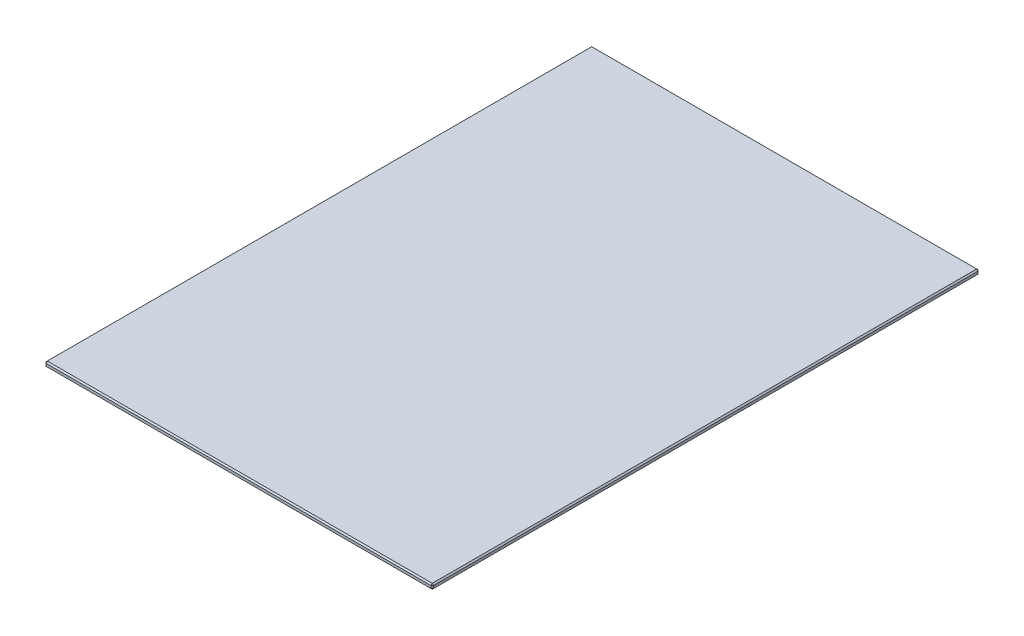
ISO-10303-21;
HEADER;
FILE_DESCRIPTION(('STEP AP214'),'2;1');
FILE_NAME('part.step','',(''),(''),'','','');
FILE_SCHEMA(('AUTOMOTIVE_DESIGN { 1 0 10303 214 1 1 1 1 }'));
ENDSEC;
DATA;
#1=APPLICATION_CONTEXT('core data for automotive mechanical design processes');
#2=APPLICATION_PROTOCOL_DEFINITION('international standard','automotive_design',2000,#1);
#3=PRODUCT_CONTEXT('',#1,'mechanical');
#4=PRODUCT('Part','Part','',(#3));
#5=PRODUCT_RELATED_PRODUCT_CATEGORY('part','',(#4));
#6=PRODUCT_DEFINITION_FORMATION('','',#4);
#7=PRODUCT_DEFINITION_CONTEXT('part definition',#1,'design');
#8=PRODUCT_DEFINITION('design','',#6,#7);
#9=PRODUCT_DEFINITION_SHAPE('','',#8);
#10=(LENGTH_UNIT() NAMED_UNIT(*) SI_UNIT(.MILLI.,.METRE.));
#11=(NAMED_UNIT(*) PLANE_ANGLE_UNIT() SI_UNIT($,.RADIAN.));
#12=(NAMED_UNIT(*) SI_UNIT($,.STERADIAN.) SOLID_ANGLE_UNIT());
#13=UNCERTAINTY_MEASURE_WITH_UNIT(LENGTH_MEASURE(1.E-05),#10,'distance_accuracy_value','');
#14=(GEOMETRIC_REPRESENTATION_CONTEXT(3) GLOBAL_UNCERTAINTY_ASSIGNED_CONTEXT((#13)) GLOBAL_UNIT_ASSIGNED_CONTEXT((#10,
#11,#12)) REPRESENTATION_CONTEXT('',''));
#15=CARTESIAN_POINT('',(0.,0.,0.));
#16=DIRECTION('',(0.,0.,1.));
#17=DIRECTION('',(1.,0.,0.));
#18=AXIS2_PLACEMENT_3D('',#15,#16,#17);
#19=CARTESIAN_POINT('',(-149.5,4.,211.));
#20=DIRECTION('',(1.,0.,0.));
#21=DIRECTION('',(0.,0.,-1.));
#22=AXIS2_PLACEMENT_3D('',#19,#20,#21);
#23=PLANE('',#22);
#24=DIRECTION('',(0.,-1.,0.));
#25=VECTOR('',#24,1.);
#26=CARTESIAN_POINT('',(-149.5,4.,-210.));
#27=LINE('',#26,#25);
#28=CARTESIAN_POINT('',(-149.5,3.,-210.));
#29=VERTEX_POINT('',#28);
#30=CARTESIAN_POINT('',(-149.5,1.,-210.));
#31=VERTEX_POINT('',#30);
#32=EDGE_CURVE('E193',#29,#31,#27,.T.);
#33=ORIENTED_EDGE('',*,*,#32,.T.);
#34=DIRECTION('',(0.,0.,1.));
#35=VECTOR('',#34,1.);
#36=CARTESIAN_POINT('',(-149.5,1.,211.));
#37=LINE('',#36,#35);
#38=CARTESIAN_POINT('',(-149.5,1.,210.));
#39=VERTEX_POINT('',#38);
#40=EDGE_CURVE('E195',#31,#39,#37,.T.);
#41=ORIENTED_EDGE('',*,*,#40,.T.);
#42=DIRECTION('',(0.,1.,0.));
#43=VECTOR('',#42,1.);
#44=CARTESIAN_POINT('',(-149.5,4.,210.));
#45=LINE('',#44,#43);
#46=CARTESIAN_POINT('',(-149.5,3.,210.));
#47=VERTEX_POINT('',#46);
#48=EDGE_CURVE('E189',#39,#47,#45,.T.);
#49=ORIENTED_EDGE('',*,*,#48,.T.);
#50=DIRECTION('',(0.,0.,-1.));
#51=VECTOR('',#50,1.);
#52=CARTESIAN_POINT('',(-149.5,3.,211.));
#53=LINE('',#52,#51);
#54=EDGE_CURVE('E191',#47,#29,#53,.T.);
#55=ORIENTED_EDGE('',*,*,#54,.T.);
#56=EDGE_LOOP('',(#33,#41,#49,#55));
#57=FACE_BOUND('',#56,.T.);
#58=ADVANCED_FACE('F34',(#57),#23,.F.);
#59=CARTESIAN_POINT('',(-149.5,4.,211.));
#60=DIRECTION('',(0.,0.,-1.));
#61=DIRECTION('',(-1.,0.,0.));
#62=AXIS2_PLACEMENT_3D('',#59,#60,#61);
#63=PLANE('',#62);
#64=DIRECTION('',(0.,-1.,0.));
#65=VECTOR('',#64,1.);
#66=CARTESIAN_POINT('',(-148.5,4.,211.));
#67=LINE('',#66,#65);
#68=CARTESIAN_POINT('',(-148.5,3.,211.));
#69=VERTEX_POINT('',#68);
#70=CARTESIAN_POINT('',(-148.5,1.,211.));
#71=VERTEX_POINT('',#70);
#72=EDGE_CURVE('E126',#69,#71,#67,.T.);
#73=ORIENTED_EDGE('',*,*,#72,.T.);
#74=DIRECTION('',(1.,0.,0.));
#75=VECTOR('',#74,1.);
#76=CARTESIAN_POINT('',(149.5,1.,211.));
#77=LINE('',#76,#75);
#78=CARTESIAN_POINT('',(148.5,1.,211.));
#79=VERTEX_POINT('',#78);
#80=EDGE_CURVE('E160',#71,#79,#77,.T.);
#81=ORIENTED_EDGE('',*,*,#80,.T.);
#82=DIRECTION('',(0.,1.,0.));
#83=VECTOR('',#82,1.);
#84=CARTESIAN_POINT('',(148.5,4.,211.));
#85=LINE('',#84,#83);
#86=CARTESIAN_POINT('',(148.5,3.,211.));
#87=VERTEX_POINT('',#86);
#88=EDGE_CURVE('E129',#79,#87,#85,.T.);
#89=ORIENTED_EDGE('',*,*,#88,.T.);
#90=DIRECTION('',(-1.,0.,0.));
#91=VECTOR('',#90,1.);
#92=CARTESIAN_POINT('',(-149.5,3.,211.));
#93=LINE('',#92,#91);
#94=EDGE_CURVE('E121',#87,#69,#93,.T.);
#95=ORIENTED_EDGE('',*,*,#94,.T.);
#96=EDGE_LOOP('',(#73,#81,#89,#95));
#97=FACE_BOUND('',#96,.T.);
#98=ADVANCED_FACE('F123',(#97),#63,.F.);
#99=CARTESIAN_POINT('',(149.5,4.,211.));
#100=DIRECTION('',(-1.,0.,0.));
#101=DIRECTION('',(0.,0.,1.));
#102=AXIS2_PLACEMENT_3D('',#99,#100,#101);
#103=PLANE('',#102);
#104=DIRECTION('',(0.,-1.,0.));
#105=VECTOR('',#104,1.);
#106=CARTESIAN_POINT('',(149.5,4.,210.));
#107=LINE('',#106,#105);
#108=CARTESIAN_POINT('',(149.5,3.,210.));
#109=VERTEX_POINT('',#108);
#110=CARTESIAN_POINT('',(149.5,1.,210.));
#111=VERTEX_POINT('',#110);
#112=EDGE_CURVE('E171',#109,#111,#107,.T.);
#113=ORIENTED_EDGE('',*,*,#112,.T.);
#114=DIRECTION('',(0.,0.,-1.));
#115=VECTOR('',#114,1.);
#116=CARTESIAN_POINT('',(149.5,1.,-211.));
#117=LINE('',#116,#115);
#118=CARTESIAN_POINT('',(149.5,1.,-210.));
#119=VERTEX_POINT('',#118);
#120=EDGE_CURVE('E177',#111,#119,#117,.T.);
#121=ORIENTED_EDGE('',*,*,#120,.T.);
#122=DIRECTION('',(0.,1.,0.));
#123=VECTOR('',#122,1.);
#124=CARTESIAN_POINT('',(149.5,4.,-210.));
#125=LINE('',#124,#123);
#126=CARTESIAN_POINT('',(149.5,3.,-210.));
#127=VERTEX_POINT('',#126);
#128=EDGE_CURVE('E175',#119,#127,#125,.T.);
#129=ORIENTED_EDGE('',*,*,#128,.T.);
#130=DIRECTION('',(0.,0.,1.));
#131=VECTOR('',#130,1.);
#132=CARTESIAN_POINT('',(149.5,3.,211.));
#133=LINE('',#132,#131);
#134=EDGE_CURVE('E173',#127,#109,#133,.T.);
#135=ORIENTED_EDGE('',*,*,#134,.T.);
#136=EDGE_LOOP('',(#113,#121,#129,#135));
#137=FACE_BOUND('',#136,.T.);
#138=ADVANCED_FACE('F264',(#137),#103,.F.);
#139=CARTESIAN_POINT('',(-149.5,4.,-211.));
#140=DIRECTION('',(0.,0.,1.));
#141=DIRECTION('',(1.,0.,0.));
#142=AXIS2_PLACEMENT_3D('',#139,#140,#141);
#143=PLANE('',#142);
#144=DIRECTION('',(1.,0.,0.));
#145=VECTOR('',#144,1.);
#146=CARTESIAN_POINT('',(-149.5,3.,-211.));
#147=LINE('',#146,#145);
#148=CARTESIAN_POINT('',(-148.5,3.,-211.));
#149=VERTEX_POINT('',#148);
#150=CARTESIAN_POINT('',(148.5,3.,-211.));
#151=VERTEX_POINT('',#150);
#152=EDGE_CURVE('E182',#149,#151,#147,.T.);
#153=ORIENTED_EDGE('',*,*,#152,.T.);
#154=DIRECTION('',(0.,-1.,0.));
#155=VECTOR('',#154,1.);
#156=CARTESIAN_POINT('',(148.5,4.,-211.));
#157=LINE('',#156,#155);
#158=CARTESIAN_POINT('',(148.5,1.,-211.));
#159=VERTEX_POINT('',#158);
#160=EDGE_CURVE('E187',#151,#159,#157,.T.);
#161=ORIENTED_EDGE('',*,*,#160,.T.);
#162=DIRECTION('',(-1.,0.,0.));
#163=VECTOR('',#162,1.);
#164=CARTESIAN_POINT('',(-149.5,1.,-211.));
#165=LINE('',#164,#163);
#166=CARTESIAN_POINT('',(-148.5,1.,-211.));
#167=VERTEX_POINT('',#166);
#168=EDGE_CURVE('E184',#159,#167,#165,.T.);
#169=ORIENTED_EDGE('',*,*,#168,.T.);
#170=DIRECTION('',(0.,1.,0.));
#171=VECTOR('',#170,1.);
#172=CARTESIAN_POINT('',(-148.5,4.,-211.));
#173=LINE('',#172,#171);
#174=EDGE_CURVE('E180',#167,#149,#173,.T.);
#175=ORIENTED_EDGE('',*,*,#174,.T.);
#176=EDGE_LOOP('',(#153,#161,#169,#175));
#177=FACE_BOUND('',#176,.T.);
#178=ADVANCED_FACE('F273',(#177),#143,.F.);
#179=CARTESIAN_POINT('',(0.,4.,0.));
#180=DIRECTION('',(0.,-1.,0.));
#181=DIRECTION('',(0.,0.,-1.));
#182=AXIS2_PLACEMENT_3D('',#179,#180,#181);
#183=PLANE('',#182);
#184=DIRECTION('',(0.,0.,-1.));
#185=VECTOR('',#184,1.);
#186=CARTESIAN_POINT('',(148.5,4.,0.));
#187=LINE('',#186,#185);
#188=CARTESIAN_POINT('',(148.5,4.,210.));
#189=VERTEX_POINT('',#188);
#190=CARTESIAN_POINT('',(148.5,4.,-210.));
#191=VERTEX_POINT('',#190);
#192=EDGE_CURVE('E43',#189,#191,#187,.T.);
#193=ORIENTED_EDGE('',*,*,#192,.T.);
#194=DIRECTION('',(-1.,0.,0.));
#195=VECTOR('',#194,1.);
#196=CARTESIAN_POINT('',(0.,4.,-210.));
#197=LINE('',#196,#195);
#198=CARTESIAN_POINT('',(-148.5,4.,-210.));
#199=VERTEX_POINT('',#198);
#200=EDGE_CURVE('E11',#191,#199,#197,.T.);
#201=ORIENTED_EDGE('',*,*,#200,.T.);
#202=DIRECTION('',(0.,0.,1.));
#203=VECTOR('',#202,1.);
#204=CARTESIAN_POINT('',(-148.5,4.,0.));
#205=LINE('',#204,#203);
#206=CARTESIAN_POINT('',(-148.5,4.,210.));
#207=VERTEX_POINT('',#206);
#208=EDGE_CURVE('E198',#199,#207,#205,.T.);
#209=ORIENTED_EDGE('',*,*,#208,.T.);
#210=DIRECTION('',(1.,0.,0.));
#211=VECTOR('',#210,1.);
#212=CARTESIAN_POINT('',(0.,4.,210.));
#213=LINE('',#212,#211);
#214=EDGE_CURVE('E54',#207,#189,#213,.T.);
#215=ORIENTED_EDGE('',*,*,#214,.T.);
#216=EDGE_LOOP('',(#193,#201,#209,#215));
#217=FACE_BOUND('',#216,.T.);
#218=ADVANCED_FACE('F295',(#217),#183,.F.);
#219=CARTESIAN_POINT('',(0.,0.,0.));
#220=DIRECTION('',(0.,-1.,0.));
#221=DIRECTION('',(0.,0.,-1.));
#222=AXIS2_PLACEMENT_3D('',#219,#220,#221);
#223=PLANE('',#222);
#224=DIRECTION('',(0.,0.,1.));
#225=VECTOR('',#224,1.);
#226=CARTESIAN_POINT('',(148.5,0.,211.));
#227=LINE('',#226,#225);
#228=CARTESIAN_POINT('',(148.5,0.,-210.));
#229=VERTEX_POINT('',#228);
#230=CARTESIAN_POINT('',(148.5,0.,210.));
#231=VERTEX_POINT('',#230);
#232=EDGE_CURVE('E166',#229,#231,#227,.T.);
#233=ORIENTED_EDGE('',*,*,#232,.T.);
#234=DIRECTION('',(-1.,0.,0.));
#235=VECTOR('',#234,1.);
#236=CARTESIAN_POINT('',(-149.5,0.,210.));
#237=LINE('',#236,#235);
#238=CARTESIAN_POINT('',(-148.5,0.,210.));
#239=VERTEX_POINT('',#238);
#240=EDGE_CURVE('E168',#231,#239,#237,.T.);
#241=ORIENTED_EDGE('',*,*,#240,.T.);
#242=DIRECTION('',(0.,0.,-1.));
#243=VECTOR('',#242,1.);
#244=CARTESIAN_POINT('',(-148.5,0.,-211.));
#245=LINE('',#244,#243);
#246=CARTESIAN_POINT('',(-148.5,0.,-210.));
#247=VERTEX_POINT('',#246);
#248=EDGE_CURVE('E162',#239,#247,#245,.T.);
#249=ORIENTED_EDGE('',*,*,#248,.T.);
#250=DIRECTION('',(1.,0.,0.));
#251=VECTOR('',#250,1.);
#252=CARTESIAN_POINT('',(149.5,0.,-210.));
#253=LINE('',#252,#251);
#254=EDGE_CURVE('E164',#247,#229,#253,.T.);
#255=ORIENTED_EDGE('',*,*,#254,.T.);
#256=EDGE_LOOP('',(#233,#241,#249,#255));
#257=FACE_BOUND('',#256,.T.);
#258=ADVANCED_FACE('F297',(#257),#223,.T.);
#259=CARTESIAN_POINT('',(0.,4.,-210.));
#260=DIRECTION('',(0.,-0.707106781186547,0.707106781186547));
#261=DIRECTION('',(-1.,0.,0.));
#262=AXIS2_PLACEMENT_3D('',#259,#260,#261);
#263=PLANE('',#262);
#264=DIRECTION('',(0.,0.707106781186547,0.707106781186547));
#265=VECTOR('',#264,1.);
#266=CARTESIAN_POINT('',(-148.5,4.,-210.));
#267=LINE('',#266,#265);
#268=EDGE_CURVE('E38',#199,#149,#267,.F.);
#269=ORIENTED_EDGE('',*,*,#268,.F.);
#270=ORIENTED_EDGE('',*,*,#200,.F.);
#271=DIRECTION('',(0.,-0.707106781186547,-0.707106781186547));
#272=VECTOR('',#271,1.);
#273=CARTESIAN_POINT('',(148.5,3.,-211.));
#274=LINE('',#273,#272);
#275=EDGE_CURVE('E157',#151,#191,#274,.F.);
#276=ORIENTED_EDGE('',*,*,#275,.F.);
#277=ORIENTED_EDGE('',*,*,#152,.F.);
#278=EDGE_LOOP('',(#269,#270,#276,#277));
#279=FACE_BOUND('',#278,.T.);
#280=ADVANCED_FACE('F36',(#279),#263,.F.);
#281=CARTESIAN_POINT('',(-148.5,4.,-210.));
#282=DIRECTION('',(-0.577350269189626,0.577350269189626,-0.577350269189626));
#283=DIRECTION('',(-0.707106781186547,0.,0.707106781186547));
#284=AXIS2_PLACEMENT_3D('',#281,#282,#283);
#285=PLANE('',#284);
#286=DIRECTION('',(-0.707106781186547,-0.707106781186547,0.));
#287=VECTOR('',#286,1.);
#288=CARTESIAN_POINT('',(-148.5,4.,-210.));
#289=LINE('',#288,#287);
#290=EDGE_CURVE('E244',#199,#29,#289,.T.);
#291=ORIENTED_EDGE('',*,*,#290,.F.);
#292=ORIENTED_EDGE('',*,*,#268,.T.);
#293=DIRECTION('',(0.707106781186547,0.,-0.707106781186547));
#294=VECTOR('',#293,1.);
#295=CARTESIAN_POINT('',(-149.,3.,-210.5));
#296=LINE('',#295,#294);
#297=EDGE_CURVE('E247',#29,#149,#296,.T.);
#298=ORIENTED_EDGE('',*,*,#297,.F.);
#299=EDGE_LOOP('',(#291,#292,#298));
#300=FACE_BOUND('',#299,.T.);
#301=ADVANCED_FACE('F291',(#300),#285,.T.);
#302=CARTESIAN_POINT('',(148.5,3.,-211.));
#303=DIRECTION('',(0.577350269189626,0.577350269189626,-0.577350269189626));
#304=DIRECTION('',(-0.707106781186547,0.,-0.707106781186547));
#305=AXIS2_PLACEMENT_3D('',#302,#303,#304);
#306=PLANE('',#305);
#307=DIRECTION('',(0.707106781186547,0.,0.707106781186547));
#308=VECTOR('',#307,1.);
#309=CARTESIAN_POINT('',(148.5,3.,-211.));
#310=LINE('',#309,#308);
#311=EDGE_CURVE('E238',#151,#127,#310,.T.);
#312=ORIENTED_EDGE('',*,*,#311,.F.);
#313=ORIENTED_EDGE('',*,*,#275,.T.);
#314=DIRECTION('',(-0.707106781186547,0.707106781186547,0.));
#315=VECTOR('',#314,1.);
#316=CARTESIAN_POINT('',(149.,3.5,-210.));
#317=LINE('',#316,#315);
#318=EDGE_CURVE('E241',#127,#191,#317,.T.);
#319=ORIENTED_EDGE('',*,*,#318,.F.);
#320=EDGE_LOOP('',(#312,#313,#319));
#321=FACE_BOUND('',#320,.T.);
#322=ADVANCED_FACE('F254',(#321),#306,.T.);
#323=CARTESIAN_POINT('',(-149.5,4.,-210.));
#324=DIRECTION('',(0.707106781186547,0.,0.707106781186547));
#325=DIRECTION('',(0.,-1.,0.));
#326=AXIS2_PLACEMENT_3D('',#323,#324,#325);
#327=PLANE('',#326);
#328=ORIENTED_EDGE('',*,*,#297,.T.);
#329=ORIENTED_EDGE('',*,*,#174,.F.);
#330=DIRECTION('',(-0.707106781186547,0.,0.707106781186547));
#331=VECTOR('',#330,1.);
#332=CARTESIAN_POINT('',(-148.5,1.,-211.));
#333=LINE('',#332,#331);
#334=EDGE_CURVE('E233',#31,#167,#333,.F.);
#335=ORIENTED_EDGE('',*,*,#334,.F.);
#336=ORIENTED_EDGE('',*,*,#32,.F.);
#337=EDGE_LOOP('',(#328,#329,#335,#336));
#338=FACE_BOUND('',#337,.T.);
#339=ADVANCED_FACE('F285',(#338),#327,.F.);
#340=CARTESIAN_POINT('',(-148.5,4.,0.));
#341=DIRECTION('',(0.707106781186547,-0.707106781186547,0.));
#342=DIRECTION('',(0.,0.,1.));
#343=AXIS2_PLACEMENT_3D('',#340,#341,#342);
#344=PLANE('',#343);
#345=ORIENTED_EDGE('',*,*,#290,.T.);
#346=ORIENTED_EDGE('',*,*,#54,.F.);
#347=DIRECTION('',(0.707106781186547,0.707106781186547,0.));
#348=VECTOR('',#347,1.);
#349=CARTESIAN_POINT('',(-149.,3.5,210.));
#350=LINE('',#349,#348);
#351=EDGE_CURVE('E141',#207,#47,#350,.F.);
#352=ORIENTED_EDGE('',*,*,#351,.F.);
#353=ORIENTED_EDGE('',*,*,#208,.F.);
#354=EDGE_LOOP('',(#345,#346,#352,#353));
#355=FACE_BOUND('',#354,.T.);
#356=ADVANCED_FACE('F294',(#355),#344,.F.);
#357=CARTESIAN_POINT('',(0.,4.,210.));
#358=DIRECTION('',(0.,-0.707106781186547,-0.707106781186547));
#359=DIRECTION('',(1.,0.,0.));
#360=AXIS2_PLACEMENT_3D('',#357,#358,#359);
#361=PLANE('',#360);
#362=DIRECTION('',(0.,0.707106781186547,-0.707106781186547));
#363=VECTOR('',#362,1.);
#364=CARTESIAN_POINT('',(148.5,3.5,210.5));
#365=LINE('',#364,#363);
#366=EDGE_CURVE('E142',#189,#87,#365,.F.);
#367=ORIENTED_EDGE('',*,*,#366,.F.);
#368=ORIENTED_EDGE('',*,*,#214,.F.);
#369=DIRECTION('',(0.,-0.707106781186547,0.707106781186547));
#370=VECTOR('',#369,1.);
#371=CARTESIAN_POINT('',(-148.5,3.,211.));
#372=LINE('',#371,#370);
#373=EDGE_CURVE('E135',#69,#207,#372,.F.);
#374=ORIENTED_EDGE('',*,*,#373,.F.);
#375=ORIENTED_EDGE('',*,*,#94,.F.);
#376=EDGE_LOOP('',(#367,#368,#374,#375));
#377=FACE_BOUND('',#376,.T.);
#378=ADVANCED_FACE('F137',(#377),#361,.F.);
#379=CARTESIAN_POINT('',(148.5,4.,0.));
#380=DIRECTION('',(-0.707106781186547,-0.707106781186547,0.));
#381=DIRECTION('',(0.,0.,-1.));
#382=AXIS2_PLACEMENT_3D('',#379,#380,#381);
#383=PLANE('',#382);
#384=ORIENTED_EDGE('',*,*,#318,.T.);
#385=ORIENTED_EDGE('',*,*,#192,.F.);
#386=DIRECTION('',(0.707106781186547,-0.707106781186547,0.));
#387=VECTOR('',#386,1.);
#388=CARTESIAN_POINT('',(149.5,3.,210.));
#389=LINE('',#388,#387);
#390=EDGE_CURVE('E228',#109,#189,#389,.F.);
#391=ORIENTED_EDGE('',*,*,#390,.F.);
#392=ORIENTED_EDGE('',*,*,#134,.F.);
#393=EDGE_LOOP('',(#384,#385,#391,#392));
#394=FACE_BOUND('',#393,.T.);
#395=ADVANCED_FACE('F260',(#394),#383,.F.);
#396=CARTESIAN_POINT('',(148.5,4.,-211.));
#397=DIRECTION('',(-0.707106781186547,0.,0.707106781186547));
#398=DIRECTION('',(0.,-1.,0.));
#399=AXIS2_PLACEMENT_3D('',#396,#397,#398);
#400=PLANE('',#399);
#401=ORIENTED_EDGE('',*,*,#311,.T.);
#402=ORIENTED_EDGE('',*,*,#128,.F.);
#403=DIRECTION('',(-0.707106781186547,0.,-0.707106781186547));
#404=VECTOR('',#403,1.);
#405=CARTESIAN_POINT('',(149.5,1.,-210.));
#406=LINE('',#405,#404);
#407=EDGE_CURVE('E225',#159,#119,#406,.F.);
#408=ORIENTED_EDGE('',*,*,#407,.F.);
#409=ORIENTED_EDGE('',*,*,#160,.F.);
#410=EDGE_LOOP('',(#401,#402,#408,#409));
#411=FACE_BOUND('',#410,.T.);
#412=ADVANCED_FACE('F270',(#411),#400,.F.);
#413=CARTESIAN_POINT('',(-149.5,1.,-211.));
#414=DIRECTION('',(0.,-0.707106781186547,-0.707106781186547));
#415=DIRECTION('',(1.,0.,0.));
#416=AXIS2_PLACEMENT_3D('',#413,#414,#415);
#417=PLANE('',#416);
#418=DIRECTION('',(0.,-0.707106781186547,0.707106781186547));
#419=VECTOR('',#418,1.);
#420=CARTESIAN_POINT('',(-148.5,1.,-211.));
#421=LINE('',#420,#419);
#422=EDGE_CURVE('E235',#167,#247,#421,.T.);
#423=ORIENTED_EDGE('',*,*,#422,.F.);
#424=ORIENTED_EDGE('',*,*,#168,.F.);
#425=DIRECTION('',(0.,0.707106781186547,-0.707106781186547));
#426=VECTOR('',#425,1.);
#427=CARTESIAN_POINT('',(148.5,0.5,-210.5));
#428=LINE('',#427,#426);
#429=EDGE_CURVE('E222',#229,#159,#428,.T.);
#430=ORIENTED_EDGE('',*,*,#429,.F.);
#431=ORIENTED_EDGE('',*,*,#254,.F.);
#432=EDGE_LOOP('',(#423,#424,#430,#431));
#433=FACE_BOUND('',#432,.T.);
#434=ADVANCED_FACE('F277',(#433),#417,.T.);
#435=CARTESIAN_POINT('',(-148.5,1.,-211.));
#436=DIRECTION('',(-0.577350269189626,-0.577350269189626,-0.577350269189626));
#437=DIRECTION('',(-0.707106781186547,0.,0.707106781186547));
#438=AXIS2_PLACEMENT_3D('',#435,#436,#437);
#439=PLANE('',#438);
#440=ORIENTED_EDGE('',*,*,#334,.T.);
#441=ORIENTED_EDGE('',*,*,#422,.T.);
#442=DIRECTION('',(-0.707106781186547,0.707106781186547,0.));
#443=VECTOR('',#442,1.);
#444=CARTESIAN_POINT('',(-149.,0.5,-210.));
#445=LINE('',#444,#443);
#446=EDGE_CURVE('E149',#31,#247,#445,.F.);
#447=ORIENTED_EDGE('',*,*,#446,.F.);
#448=EDGE_LOOP('',(#440,#441,#447));
#449=FACE_BOUND('',#448,.T.);
#450=ADVANCED_FACE('F351',(#449),#439,.T.);
#451=CARTESIAN_POINT('',(-148.5,3.,211.));
#452=DIRECTION('',(-0.577350269189626,0.577350269189626,0.577350269189626));
#453=DIRECTION('',(0.707106781186547,0.,0.707106781186547));
#454=AXIS2_PLACEMENT_3D('',#451,#452,#453);
#455=PLANE('',#454);
#456=ORIENTED_EDGE('',*,*,#373,.T.);
#457=ORIENTED_EDGE('',*,*,#351,.T.);
#458=DIRECTION('',(-0.707106781186547,0.,-0.707106781186547));
#459=VECTOR('',#458,1.);
#460=CARTESIAN_POINT('',(-148.5,3.,211.));
#461=LINE('',#460,#459);
#462=EDGE_CURVE('E145',#69,#47,#461,.T.);
#463=ORIENTED_EDGE('',*,*,#462,.F.);
#464=EDGE_LOOP('',(#456,#457,#463));
#465=FACE_BOUND('',#464,.T.);
#466=ADVANCED_FACE('F146',(#465),#455,.T.);
#467=CARTESIAN_POINT('',(149.5,3.,210.));
#468=DIRECTION('',(0.577350269189626,0.577350269189626,0.577350269189626));
#469=DIRECTION('',(0.707106781186547,0.,-0.707106781186547));
#470=AXIS2_PLACEMENT_3D('',#467,#468,#469);
#471=PLANE('',#470);
#472=ORIENTED_EDGE('',*,*,#390,.T.);
#473=ORIENTED_EDGE('',*,*,#366,.T.);
#474=DIRECTION('',(-0.707106781186547,0.,0.707106781186547));
#475=VECTOR('',#474,1.);
#476=CARTESIAN_POINT('',(149.5,3.,210.));
#477=LINE('',#476,#475);
#478=EDGE_CURVE('E150',#109,#87,#477,.T.);
#479=ORIENTED_EDGE('',*,*,#478,.F.);
#480=EDGE_LOOP('',(#472,#473,#479));
#481=FACE_BOUND('',#480,.T.);
#482=ADVANCED_FACE('F344',(#481),#471,.T.);
#483=CARTESIAN_POINT('',(149.5,1.,-210.));
#484=DIRECTION('',(0.577350269189626,-0.577350269189626,-0.577350269189626));
#485=DIRECTION('',(-0.707106781186547,0.,-0.707106781186547));
#486=AXIS2_PLACEMENT_3D('',#483,#484,#485);
#487=PLANE('',#486);
#488=ORIENTED_EDGE('',*,*,#429,.T.);
#489=ORIENTED_EDGE('',*,*,#407,.T.);
#490=DIRECTION('',(-0.707106781186547,-0.707106781186547,0.));
#491=VECTOR('',#490,1.);
#492=CARTESIAN_POINT('',(149.5,1.,-210.));
#493=LINE('',#492,#491);
#494=EDGE_CURVE('E216',#229,#119,#493,.F.);
#495=ORIENTED_EDGE('',*,*,#494,.F.);
#496=EDGE_LOOP('',(#488,#489,#495));
#497=FACE_BOUND('',#496,.T.);
#498=ADVANCED_FACE('F340',(#497),#487,.T.);
#499=CARTESIAN_POINT('',(-149.5,1.,211.));
#500=DIRECTION('',(-0.707106781186547,-0.707106781186547,0.));
#501=DIRECTION('',(0.,0.,-1.));
#502=AXIS2_PLACEMENT_3D('',#499,#500,#501);
#503=PLANE('',#502);
#504=ORIENTED_EDGE('',*,*,#446,.T.);
#505=ORIENTED_EDGE('',*,*,#248,.F.);
#506=DIRECTION('',(0.707106781186547,-0.707106781186547,0.));
#507=VECTOR('',#506,1.);
#508=CARTESIAN_POINT('',(-148.5,0.,210.));
#509=LINE('',#508,#507);
#510=EDGE_CURVE('E213',#39,#239,#509,.T.);
#511=ORIENTED_EDGE('',*,*,#510,.F.);
#512=ORIENTED_EDGE('',*,*,#40,.F.);
#513=EDGE_LOOP('',(#504,#505,#511,#512));
#514=FACE_BOUND('',#513,.T.);
#515=ADVANCED_FACE('F337',(#514),#503,.T.);
#516=CARTESIAN_POINT('',(-148.5,4.,211.));
#517=DIRECTION('',(0.707106781186547,0.,-0.707106781186547));
#518=DIRECTION('',(0.,-1.,0.));
#519=AXIS2_PLACEMENT_3D('',#516,#517,#518);
#520=PLANE('',#519);
#521=ORIENTED_EDGE('',*,*,#462,.T.);
#522=ORIENTED_EDGE('',*,*,#48,.F.);
#523=DIRECTION('',(0.707106781186547,0.,0.707106781186547));
#524=VECTOR('',#523,1.);
#525=CARTESIAN_POINT('',(-149.,1.,210.5));
#526=LINE('',#525,#524);
#527=EDGE_CURVE('E153',#71,#39,#526,.F.);
#528=ORIENTED_EDGE('',*,*,#527,.F.);
#529=ORIENTED_EDGE('',*,*,#72,.F.);
#530=EDGE_LOOP('',(#521,#522,#528,#529));
#531=FACE_BOUND('',#530,.T.);
#532=ADVANCED_FACE('F152',(#531),#520,.F.);
#533=CARTESIAN_POINT('',(149.5,4.,210.));
#534=DIRECTION('',(-0.707106781186547,0.,-0.707106781186547));
#535=DIRECTION('',(0.,-1.,0.));
#536=AXIS2_PLACEMENT_3D('',#533,#534,#535);
#537=PLANE('',#536);
#538=ORIENTED_EDGE('',*,*,#478,.T.);
#539=ORIENTED_EDGE('',*,*,#88,.F.);
#540=DIRECTION('',(0.707106781186547,0.,-0.707106781186547));
#541=VECTOR('',#540,1.);
#542=CARTESIAN_POINT('',(148.5,1.,211.));
#543=LINE('',#542,#541);
#544=EDGE_CURVE('E209',#111,#79,#543,.F.);
#545=ORIENTED_EDGE('',*,*,#544,.F.);
#546=ORIENTED_EDGE('',*,*,#112,.F.);
#547=EDGE_LOOP('',(#538,#539,#545,#546));
#548=FACE_BOUND('',#547,.T.);
#549=ADVANCED_FACE('F330',(#548),#537,.F.);
#550=CARTESIAN_POINT('',(149.5,1.,211.));
#551=DIRECTION('',(0.707106781186547,-0.707106781186547,0.));
#552=DIRECTION('',(0.,0.,1.));
#553=AXIS2_PLACEMENT_3D('',#550,#551,#552);
#554=PLANE('',#553);
#555=ORIENTED_EDGE('',*,*,#494,.T.);
#556=ORIENTED_EDGE('',*,*,#120,.F.);
#557=DIRECTION('',(0.707106781186547,0.707106781186547,0.));
#558=VECTOR('',#557,1.);
#559=CARTESIAN_POINT('',(149.,0.5,210.));
#560=LINE('',#559,#558);
#561=EDGE_CURVE('E206',#231,#111,#560,.T.);
#562=ORIENTED_EDGE('',*,*,#561,.F.);
#563=ORIENTED_EDGE('',*,*,#232,.F.);
#564=EDGE_LOOP('',(#555,#556,#562,#563));
#565=FACE_BOUND('',#564,.T.);
#566=ADVANCED_FACE('F326',(#565),#554,.T.);
#567=CARTESIAN_POINT('',(-148.5,0.,210.));
#568=DIRECTION('',(-0.577350269189626,-0.577350269189626,0.577350269189626));
#569=DIRECTION('',(0.707106781186547,0.,0.707106781186547));
#570=AXIS2_PLACEMENT_3D('',#567,#568,#569);
#571=PLANE('',#570);
#572=ORIENTED_EDGE('',*,*,#527,.T.);
#573=ORIENTED_EDGE('',*,*,#510,.T.);
#574=DIRECTION('',(0.,0.707106781186547,0.707106781186547));
#575=VECTOR('',#574,1.);
#576=CARTESIAN_POINT('',(-148.5,0.,210.));
#577=LINE('',#576,#575);
#578=EDGE_CURVE('E204',#71,#239,#577,.F.);
#579=ORIENTED_EDGE('',*,*,#578,.F.);
#580=EDGE_LOOP('',(#572,#573,#579));
#581=FACE_BOUND('',#580,.T.);
#582=ADVANCED_FACE('F322',(#581),#571,.T.);
#583=CARTESIAN_POINT('',(148.5,1.,211.));
#584=DIRECTION('',(0.577350269189626,-0.577350269189626,0.577350269189626));
#585=DIRECTION('',(0.707106781186547,0.,-0.707106781186547));
#586=AXIS2_PLACEMENT_3D('',#583,#584,#585);
#587=PLANE('',#586);
#588=ORIENTED_EDGE('',*,*,#561,.T.);
#589=ORIENTED_EDGE('',*,*,#544,.T.);
#590=DIRECTION('',(0.,-0.707106781186547,-0.707106781186547));
#591=VECTOR('',#590,1.);
#592=CARTESIAN_POINT('',(148.5,1.,211.));
#593=LINE('',#592,#591);
#594=EDGE_CURVE('E202',#231,#79,#593,.F.);
#595=ORIENTED_EDGE('',*,*,#594,.F.);
#596=EDGE_LOOP('',(#588,#589,#595));
#597=FACE_BOUND('',#596,.T.);
#598=ADVANCED_FACE('F318',(#597),#587,.T.);
#599=CARTESIAN_POINT('',(-149.5,1.,211.));
#600=DIRECTION('',(0.,-0.707106781186547,0.707106781186547));
#601=DIRECTION('',(-1.,0.,0.));
#602=AXIS2_PLACEMENT_3D('',#599,#600,#601);
#603=PLANE('',#602);
#604=ORIENTED_EDGE('',*,*,#578,.T.);
#605=ORIENTED_EDGE('',*,*,#240,.F.);
#606=ORIENTED_EDGE('',*,*,#594,.T.);
#607=ORIENTED_EDGE('',*,*,#80,.F.);
#608=EDGE_LOOP('',(#604,#605,#606,#607));
#609=FACE_BOUND('',#608,.T.);
#610=ADVANCED_FACE('F315',(#609),#603,.T.);
#611=CLOSED_SHELL('',(#58,#98,#138,#178,#218,#258,#280,#301,#322,#339,#356,#378,#395,#412,#434,
#450,#466,#482,#498,#515,#532,#549,#566,#582,#598,#610));
#612=MANIFOLD_SOLID_BREP('B2',#611);
#613=ADVANCED_BREP_SHAPE_REPRESENTATION('',(#18,#612),#14);
#614=SHAPE_DEFINITION_REPRESENTATION(#9,#613);
ENDSEC;
END-ISO-10303-21;
